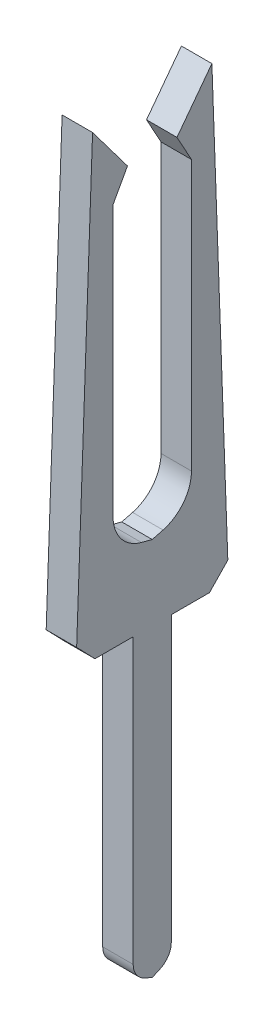
ISO-10303-21;
HEADER;
FILE_DESCRIPTION(('STEP AP214'),'2;1');
FILE_NAME('part.step','',(''),(''),'','','');
FILE_SCHEMA(('AUTOMOTIVE_DESIGN { 1 0 10303 214 1 1 1 1 }'));
ENDSEC;
DATA;
#1=APPLICATION_CONTEXT('core data for automotive mechanical design processes');
#2=APPLICATION_PROTOCOL_DEFINITION('international standard','automotive_design',2000,#1);
#3=PRODUCT_CONTEXT('',#1,'mechanical');
#4=PRODUCT('Part','Part','',(#3));
#5=PRODUCT_RELATED_PRODUCT_CATEGORY('part','',(#4));
#6=PRODUCT_DEFINITION_FORMATION('','',#4);
#7=PRODUCT_DEFINITION_CONTEXT('part definition',#1,'design');
#8=PRODUCT_DEFINITION('design','',#6,#7);
#9=PRODUCT_DEFINITION_SHAPE('','',#8);
#10=(LENGTH_UNIT() NAMED_UNIT(*) SI_UNIT(.MILLI.,.METRE.));
#11=(NAMED_UNIT(*) PLANE_ANGLE_UNIT() SI_UNIT($,.RADIAN.));
#12=(NAMED_UNIT(*) SI_UNIT($,.STERADIAN.) SOLID_ANGLE_UNIT());
#13=UNCERTAINTY_MEASURE_WITH_UNIT(LENGTH_MEASURE(1.E-05),#10,'distance_accuracy_value','');
#14=(GEOMETRIC_REPRESENTATION_CONTEXT(3) GLOBAL_UNCERTAINTY_ASSIGNED_CONTEXT((#13)) GLOBAL_UNIT_ASSIGNED_CONTEXT((#10,
#11,#12)) REPRESENTATION_CONTEXT('',''));
#15=CARTESIAN_POINT('',(0.,0.,0.));
#16=DIRECTION('',(0.,0.,1.));
#17=DIRECTION('',(1.,0.,0.));
#18=AXIS2_PLACEMENT_3D('',#15,#16,#17);
#19=CARTESIAN_POINT('',(0.4,2.15627423693323,0.277438328452502));
#20=DIRECTION('',(0.,0.694137309805425,0.71984261831048));
#21=DIRECTION('',(0.,-0.71984261831048,0.694137309805425));
#22=AXIS2_PLACEMENT_3D('',#19,#20,#21);
#23=PLANE('',#22);
#24=DIRECTION('',(0.,0.71984261831048,-0.694137309805425));
#25=VECTOR('',#24,1.);
#26=CARTESIAN_POINT('',(0.,2.15627423693323,0.277438328452502));
#27=LINE('',#26,#25);
#28=CARTESIAN_POINT('',(0.,1.90643942765456,0.518351630884458));
#29=VERTEX_POINT('',#28);
#30=CARTESIAN_POINT('',(0.,2.15627423693323,0.277438328452502));
#31=VERTEX_POINT('',#30);
#32=EDGE_CURVE('E215',#29,#31,#27,.T.);
#33=ORIENTED_EDGE('',*,*,#32,.T.);
#34=DIRECTION('',(-1.,0.,0.));
#35=VECTOR('',#34,1.);
#36=CARTESIAN_POINT('',(0.4,2.15627423693323,0.277438328452502));
#37=LINE('',#36,#35);
#38=CARTESIAN_POINT('',(0.4,2.15627423693323,0.277438328452502));
#39=VERTEX_POINT('',#38);
#40=EDGE_CURVE('E11',#39,#31,#37,.T.);
#41=ORIENTED_EDGE('',*,*,#40,.F.);
#42=DIRECTION('',(0.,0.71984261831048,-0.694137309805425));
#43=VECTOR('',#42,1.);
#44=CARTESIAN_POINT('',(0.4,2.15627423693323,0.277438328452502));
#45=LINE('',#44,#43);
#46=CARTESIAN_POINT('',(0.4,1.90643942765456,0.518351630884458));
#47=VERTEX_POINT('',#46);
#48=EDGE_CURVE('E257',#47,#39,#45,.T.);
#49=ORIENTED_EDGE('',*,*,#48,.F.);
#50=DIRECTION('',(-1.,0.,0.));
#51=VECTOR('',#50,1.);
#52=CARTESIAN_POINT('',(0.4,1.90643942765456,0.518351630884458));
#53=LINE('',#52,#51);
#54=EDGE_CURVE('E211',#47,#29,#53,.T.);
#55=ORIENTED_EDGE('',*,*,#54,.T.);
#56=EDGE_LOOP('',(#33,#41,#49,#55));
#57=FACE_BOUND('',#56,.T.);
#58=ADVANCED_FACE('F35',(#57),#23,.F.);
#59=CARTESIAN_POINT('',(0.4,7.90643942765456,0.486576567456251));
#60=DIRECTION('',(0.,-0.036346790272175,0.99933923711466));
#61=DIRECTION('',(0.,-0.99933923711466,-0.036346790272175));
#62=AXIS2_PLACEMENT_3D('',#59,#60,#61);
#63=PLANE('',#62);
#64=DIRECTION('',(0.,0.99933923711466,0.036346790272175));
#65=VECTOR('',#64,1.);
#66=CARTESIAN_POINT('',(0.,7.90643942765456,0.486576567456251));
#67=LINE('',#66,#65);
#68=CARTESIAN_POINT('',(0.,7.90643942765456,0.486576567456251));
#69=VERTEX_POINT('',#68);
#70=EDGE_CURVE('E218',#31,#69,#67,.T.);
#71=ORIENTED_EDGE('',*,*,#70,.T.);
#72=DIRECTION('',(-1.,0.,0.));
#73=VECTOR('',#72,1.);
#74=CARTESIAN_POINT('',(0.4,7.90643942765456,0.486576567456251));
#75=LINE('',#74,#73);
#76=CARTESIAN_POINT('',(0.4,7.90643942765456,0.486576567456251));
#77=VERTEX_POINT('',#76);
#78=EDGE_CURVE('E43',#77,#69,#75,.T.);
#79=ORIENTED_EDGE('',*,*,#78,.F.);
#80=DIRECTION('',(0.,0.99933923711466,0.036346790272175));
#81=VECTOR('',#80,1.);
#82=CARTESIAN_POINT('',(0.4,7.90643942765456,0.486576567456251));
#83=LINE('',#82,#81);
#84=EDGE_CURVE('E136',#39,#77,#83,.T.);
#85=ORIENTED_EDGE('',*,*,#84,.F.);
#86=ORIENTED_EDGE('',*,*,#40,.T.);
#87=EDGE_LOOP('',(#71,#79,#85,#86));
#88=FACE_BOUND('',#87,.T.);
#89=ADVANCED_FACE('F385',(#88),#63,.F.);
#90=CARTESIAN_POINT('',(0.4,7.29691604158744,0.944947879463951));
#91=DIRECTION('',(0.,-0.601030672473663,-0.799225957252301));
#92=DIRECTION('',(0.,0.799225957252301,-0.601030672473663));
#93=AXIS2_PLACEMENT_3D('',#90,#91,#92);
#94=PLANE('',#93);
#95=DIRECTION('',(0.,-0.799225957252301,0.601030672473663));
#96=VECTOR('',#95,1.);
#97=CARTESIAN_POINT('',(0.,7.29691604158744,0.944947879463951));
#98=LINE('',#97,#96);
#99=CARTESIAN_POINT('',(0.,7.29691604158744,0.944947879463951));
#100=VERTEX_POINT('',#99);
#101=EDGE_CURVE('E220',#69,#100,#98,.T.);
#102=ORIENTED_EDGE('',*,*,#101,.T.);
#103=DIRECTION('',(-1.,0.,0.));
#104=VECTOR('',#103,1.);
#105=CARTESIAN_POINT('',(0.4,7.29691604158744,0.944947879463951));
#106=LINE('',#105,#104);
#107=CARTESIAN_POINT('',(0.4,7.29691604158744,0.944947879463951));
#108=VERTEX_POINT('',#107);
#109=EDGE_CURVE('E306',#108,#100,#106,.T.);
#110=ORIENTED_EDGE('',*,*,#109,.F.);
#111=DIRECTION('',(0.,-0.799225957252301,0.601030672473663));
#112=VECTOR('',#111,1.);
#113=CARTESIAN_POINT('',(0.4,7.29691604158744,0.944947879463951));
#114=LINE('',#113,#112);
#115=EDGE_CURVE('E314',#77,#108,#114,.T.);
#116=ORIENTED_EDGE('',*,*,#115,.F.);
#117=ORIENTED_EDGE('',*,*,#78,.T.);
#118=EDGE_LOOP('',(#102,#110,#116,#117));
#119=FACE_BOUND('',#118,.T.);
#120=ADVANCED_FACE('F312',(#119),#94,.F.);
#121=CARTESIAN_POINT('',(0.4,6.95011825296304,0.754777343997982));
#122=DIRECTION('',(0.,0.480815317239039,-0.876821892238283));
#123=DIRECTION('',(0.,0.876821892238283,0.480815317239039));
#124=AXIS2_PLACEMENT_3D('',#121,#122,#123);
#125=PLANE('',#124);
#126=DIRECTION('',(0.,-0.876821892238283,-0.480815317239039));
#127=VECTOR('',#126,1.);
#128=CARTESIAN_POINT('',(0.,6.95011825296304,0.754777343997982));
#129=LINE('',#128,#127);
#130=CARTESIAN_POINT('',(0.,6.95011825296304,0.754777343997982));
#131=VERTEX_POINT('',#130);
#132=EDGE_CURVE('E222',#100,#131,#129,.T.);
#133=ORIENTED_EDGE('',*,*,#132,.T.);
#134=DIRECTION('',(-1.,0.,0.));
#135=VECTOR('',#134,1.);
#136=CARTESIAN_POINT('',(0.4,6.95011825296304,0.754777343997982));
#137=LINE('',#136,#135);
#138=CARTESIAN_POINT('',(0.4,6.95011825296304,0.754777343997982));
#139=VERTEX_POINT('',#138);
#140=EDGE_CURVE('E303',#139,#131,#137,.T.);
#141=ORIENTED_EDGE('',*,*,#140,.F.);
#142=DIRECTION('',(0.,-0.876821892238283,-0.480815317239039));
#143=VECTOR('',#142,1.);
#144=CARTESIAN_POINT('',(0.4,6.95011825296304,0.754777343997982));
#145=LINE('',#144,#143);
#146=EDGE_CURVE('E332',#108,#139,#145,.T.);
#147=ORIENTED_EDGE('',*,*,#146,.F.);
#148=ORIENTED_EDGE('',*,*,#109,.T.);
#149=EDGE_LOOP('',(#133,#141,#147,#148));
#150=FACE_BOUND('',#149,.T.);
#151=ADVANCED_FACE('F323',(#150),#125,.F.);
#152=CARTESIAN_POINT('',(0.4,3.40759606010662,0.754710604299908));
#153=DIRECTION('',(0.,1.88395991410638E-05,-0.999999999822535));
#154=DIRECTION('',(0.,0.999999999822535,1.88395991410638E-05));
#155=AXIS2_PLACEMENT_3D('',#152,#153,#154);
#156=PLANE('',#155);
#157=DIRECTION('',(0.,-0.999999999822535,-1.88395991410638E-05));
#158=VECTOR('',#157,1.);
#159=CARTESIAN_POINT('',(0.,3.40759606010662,0.754710604299908));
#160=LINE('',#159,#158);
#161=CARTESIAN_POINT('',(0.,3.40759606010662,0.754710604299908));
#162=VERTEX_POINT('',#161);
#163=EDGE_CURVE('E224',#131,#162,#160,.T.);
#164=ORIENTED_EDGE('',*,*,#163,.T.);
#165=DIRECTION('',(-1.,0.,0.));
#166=VECTOR('',#165,1.);
#167=CARTESIAN_POINT('',(0.4,3.40759606010662,0.754710604299908));
#168=LINE('',#167,#166);
#169=CARTESIAN_POINT('',(0.4,3.40759606010662,0.754710604299908));
#170=VERTEX_POINT('',#169);
#171=EDGE_CURVE('E300',#170,#162,#168,.T.);
#172=ORIENTED_EDGE('',*,*,#171,.F.);
#173=DIRECTION('',(0.,-0.999999999822535,-1.88395991410638E-05));
#174=VECTOR('',#173,1.);
#175=CARTESIAN_POINT('',(0.4,3.40759606010662,0.754710604299908));
#176=LINE('',#175,#174);
#177=EDGE_CURVE('E329',#139,#170,#176,.T.);
#178=ORIENTED_EDGE('',*,*,#177,.F.);
#179=ORIENTED_EDGE('',*,*,#140,.T.);
#180=EDGE_LOOP('',(#164,#172,#178,#179));
#181=FACE_BOUND('',#180,.T.);
#182=ADVANCED_FACE('F327',(#181),#156,.F.);
#183=CARTESIAN_POINT('',(0.4,3.40758664030705,1.25471060421118));
#184=DIRECTION('',(-1.,0.,0.));
#185=DIRECTION('',(0.,0.,1.));
#186=AXIS2_PLACEMENT_3D('',#183,#184,#185);
#187=CYLINDRICAL_SURFACE('',#186,0.5);
#188=CARTESIAN_POINT('',(0.,3.40758664030705,1.25471060421118));
#189=DIRECTION('',(-1.,0.,0.));
#190=DIRECTION('',(0.,0.,-1.));
#191=AXIS2_PLACEMENT_3D('',#188,#189,#190);
#192=CIRCLE('',#191,0.5);
#193=CARTESIAN_POINT('',(0.,2.92391221511593,1.127986295509));
#194=VERTEX_POINT('',#193);
#195=EDGE_CURVE('E226',#162,#194,#192,.T.);
#196=ORIENTED_EDGE('',*,*,#195,.T.);
#197=DIRECTION('',(-1.,0.,0.));
#198=VECTOR('',#197,1.);
#199=CARTESIAN_POINT('',(0.4,2.92391221511593,1.127986295509));
#200=LINE('',#199,#198);
#201=CARTESIAN_POINT('',(0.4,2.92391221511593,1.127986295509));
#202=VERTEX_POINT('',#201);
#203=EDGE_CURVE('E297',#202,#194,#200,.T.);
#204=ORIENTED_EDGE('',*,*,#203,.F.);
#205=CARTESIAN_POINT('',(0.4,3.40758664030705,1.25471060421118));
#206=DIRECTION('',(-1.,0.,0.));
#207=DIRECTION('',(0.,0.,-1.));
#208=AXIS2_PLACEMENT_3D('',#205,#206,#207);
#209=CIRCLE('',#208,0.5);
#210=EDGE_CURVE('E331',#170,#202,#209,.T.);
#211=ORIENTED_EDGE('',*,*,#210,.F.);
#212=ORIENTED_EDGE('',*,*,#171,.T.);
#213=EDGE_LOOP('',(#196,#204,#211,#212));
#214=FACE_BOUND('',#213,.T.);
#215=ADVANCED_FACE('F398',(#214),#187,.F.);
#216=CARTESIAN_POINT('',(0.4,2.88671780777912,1.26994787946395));
#217=DIRECTION('',(0.,-0.967348850382229,-0.253448617404358));
#218=DIRECTION('',(0.,0.253448617404358,-0.967348850382229));
#219=AXIS2_PLACEMENT_3D('',#216,#217,#218);
#220=PLANE('',#219);
#221=DIRECTION('',(0.,-0.253448617404358,0.967348850382229));
#222=VECTOR('',#221,1.);
#223=CARTESIAN_POINT('',(0.,2.88671780777912,1.26994787946395));
#224=LINE('',#223,#222);
#225=CARTESIAN_POINT('',(0.,2.88671780777912,1.26994787946395));
#226=VERTEX_POINT('',#225);
#227=EDGE_CURVE('E228',#194,#226,#224,.T.);
#228=ORIENTED_EDGE('',*,*,#227,.T.);
#229=DIRECTION('',(-1.,0.,0.));
#230=VECTOR('',#229,1.);
#231=CARTESIAN_POINT('',(0.4,2.88671780777912,1.26994787946395));
#232=LINE('',#231,#230);
#233=CARTESIAN_POINT('',(0.4,2.88671780777912,1.26994787946395));
#234=VERTEX_POINT('',#233);
#235=EDGE_CURVE('E294',#234,#226,#232,.T.);
#236=ORIENTED_EDGE('',*,*,#235,.F.);
#237=DIRECTION('',(0.,-0.253448617404358,0.967348850382229));
#238=VECTOR('',#237,1.);
#239=CARTESIAN_POINT('',(0.4,2.88671780777912,1.26994787946395));
#240=LINE('',#239,#238);
#241=EDGE_CURVE('E334',#202,#234,#240,.T.);
#242=ORIENTED_EDGE('',*,*,#241,.F.);
#243=ORIENTED_EDGE('',*,*,#203,.T.);
#244=EDGE_LOOP('',(#228,#236,#242,#243));
#245=FACE_BOUND('',#244,.T.);
#246=ADVANCED_FACE('F401',(#245),#220,.F.);
#247=CARTESIAN_POINT('',(0.4,2.88671780777912,1.26994787946395));
#248=DIRECTION('',(0.,-0.967348850382229,0.253448617404358));
#249=DIRECTION('',(0.,-0.253448617404358,-0.967348850382229));
#250=AXIS2_PLACEMENT_3D('',#247,#248,#249);
#251=PLANE('',#250);
#252=DIRECTION('',(0.,0.253448617404358,0.967348850382229));
#253=VECTOR('',#252,1.);
#254=CARTESIAN_POINT('',(0.,2.88671780777912,1.26994787946395));
#255=LINE('',#254,#253);
#256=CARTESIAN_POINT('',(0.,2.92391221511593,1.4119094634189));
#257=VERTEX_POINT('',#256);
#258=EDGE_CURVE('E230',#226,#257,#255,.T.);
#259=ORIENTED_EDGE('',*,*,#258,.T.);
#260=DIRECTION('',(-1.,0.,0.));
#261=VECTOR('',#260,1.);
#262=CARTESIAN_POINT('',(0.4,2.92391221511593,1.4119094634189));
#263=LINE('',#262,#261);
#264=CARTESIAN_POINT('',(0.4,2.92391221511593,1.4119094634189));
#265=VERTEX_POINT('',#264);
#266=EDGE_CURVE('E291',#265,#257,#263,.T.);
#267=ORIENTED_EDGE('',*,*,#266,.F.);
#268=DIRECTION('',(0.,0.253448617404358,0.967348850382229));
#269=VECTOR('',#268,1.);
#270=CARTESIAN_POINT('',(0.4,2.88671780777912,1.26994787946395));
#271=LINE('',#270,#269);
#272=EDGE_CURVE('E340',#234,#265,#271,.T.);
#273=ORIENTED_EDGE('',*,*,#272,.F.);
#274=ORIENTED_EDGE('',*,*,#235,.T.);
#275=EDGE_LOOP('',(#259,#267,#273,#274));
#276=FACE_BOUND('',#275,.T.);
#277=ADVANCED_FACE('F405',(#276),#251,.F.);
#278=CARTESIAN_POINT('',(0.4,3.40758664030705,1.28518515471672));
#279=DIRECTION('',(-1.,0.,0.));
#280=DIRECTION('',(0.,0.,1.));
#281=AXIS2_PLACEMENT_3D('',#278,#279,#280);
#282=CYLINDRICAL_SURFACE('',#281,0.5);
#283=CARTESIAN_POINT('',(0.,3.40758664030705,1.28518515471672));
#284=DIRECTION('',(-1.,0.,0.));
#285=DIRECTION('',(0.,0.,1.));
#286=AXIS2_PLACEMENT_3D('',#283,#284,#285);
#287=CIRCLE('',#286,0.5);
#288=CARTESIAN_POINT('',(0.,3.40759606010662,1.78518515462799));
#289=VERTEX_POINT('',#288);
#290=EDGE_CURVE('E232',#257,#289,#287,.T.);
#291=ORIENTED_EDGE('',*,*,#290,.T.);
#292=DIRECTION('',(-1.,0.,0.));
#293=VECTOR('',#292,1.);
#294=CARTESIAN_POINT('',(0.4,3.40759606010662,1.78518515462799));
#295=LINE('',#294,#293);
#296=CARTESIAN_POINT('',(0.4,3.40759606010662,1.78518515462799));
#297=VERTEX_POINT('',#296);
#298=EDGE_CURVE('E288',#297,#289,#295,.T.);
#299=ORIENTED_EDGE('',*,*,#298,.F.);
#300=CARTESIAN_POINT('',(0.4,3.40758664030705,1.28518515471672));
#301=DIRECTION('',(-1.,0.,0.));
#302=DIRECTION('',(0.,0.,1.));
#303=AXIS2_PLACEMENT_3D('',#300,#301,#302);
#304=CIRCLE('',#303,0.5);
#305=EDGE_CURVE('E342',#265,#297,#304,.T.);
#306=ORIENTED_EDGE('',*,*,#305,.F.);
#307=ORIENTED_EDGE('',*,*,#266,.T.);
#308=EDGE_LOOP('',(#291,#299,#306,#307));
#309=FACE_BOUND('',#308,.T.);
#310=ADVANCED_FACE('F409',(#309),#282,.F.);
#311=CARTESIAN_POINT('',(0.4,3.40759606010662,1.78518515462799));
#312=DIRECTION('',(0.,1.88395991408802E-05,0.999999999822535));
#313=DIRECTION('',(0.,-0.999999999822535,1.88395991408802E-05));
#314=AXIS2_PLACEMENT_3D('',#311,#312,#313);
#315=PLANE('',#314);
#316=DIRECTION('',(0.,0.999999999822535,-1.88395991408802E-05));
#317=VECTOR('',#316,1.);
#318=CARTESIAN_POINT('',(0.,3.40759606010662,1.78518515462799));
#319=LINE('',#318,#317);
#320=CARTESIAN_POINT('',(0.,6.95011825296304,1.78511841492992));
#321=VERTEX_POINT('',#320);
#322=EDGE_CURVE('E234',#289,#321,#319,.T.);
#323=ORIENTED_EDGE('',*,*,#322,.T.);
#324=DIRECTION('',(-1.,0.,0.));
#325=VECTOR('',#324,1.);
#326=CARTESIAN_POINT('',(0.4,6.95011825296304,1.78511841492992));
#327=LINE('',#326,#325);
#328=CARTESIAN_POINT('',(0.4,6.95011825296304,1.78511841492992));
#329=VERTEX_POINT('',#328);
#330=EDGE_CURVE('E285',#329,#321,#327,.T.);
#331=ORIENTED_EDGE('',*,*,#330,.F.);
#332=DIRECTION('',(0.,0.999999999822535,-1.88395991408802E-05));
#333=VECTOR('',#332,1.);
#334=CARTESIAN_POINT('',(0.4,3.40759606010662,1.78518515462799));
#335=LINE('',#334,#333);
#336=EDGE_CURVE('E344',#297,#329,#335,.T.);
#337=ORIENTED_EDGE('',*,*,#336,.F.);
#338=ORIENTED_EDGE('',*,*,#298,.T.);
#339=EDGE_LOOP('',(#323,#331,#337,#338));
#340=FACE_BOUND('',#339,.T.);
#341=ADVANCED_FACE('F413',(#340),#315,.F.);
#342=CARTESIAN_POINT('',(0.4,6.95011825296304,1.78511841492992));
#343=DIRECTION('',(0.,0.480815317239038,0.876821892238283));
#344=DIRECTION('',(0.,-0.876821892238283,0.480815317239038));
#345=AXIS2_PLACEMENT_3D('',#342,#343,#344);
#346=PLANE('',#345);
#347=DIRECTION('',(0.,0.876821892238283,-0.480815317239038));
#348=VECTOR('',#347,1.);
#349=CARTESIAN_POINT('',(0.,6.95011825296304,1.78511841492992));
#350=LINE('',#349,#348);
#351=CARTESIAN_POINT('',(0.,7.29691604158744,1.59494787946395));
#352=VERTEX_POINT('',#351);
#353=EDGE_CURVE('E236',#321,#352,#350,.T.);
#354=ORIENTED_EDGE('',*,*,#353,.T.);
#355=DIRECTION('',(-1.,0.,0.));
#356=VECTOR('',#355,1.);
#357=CARTESIAN_POINT('',(0.4,7.29691604158744,1.59494787946395));
#358=LINE('',#357,#356);
#359=CARTESIAN_POINT('',(0.4,7.29691604158744,1.59494787946395));
#360=VERTEX_POINT('',#359);
#361=EDGE_CURVE('E282',#360,#352,#358,.T.);
#362=ORIENTED_EDGE('',*,*,#361,.F.);
#363=DIRECTION('',(0.,0.876821892238283,-0.480815317239038));
#364=VECTOR('',#363,1.);
#365=CARTESIAN_POINT('',(0.4,6.95011825296304,1.78511841492992));
#366=LINE('',#365,#364);
#367=EDGE_CURVE('E346',#329,#360,#366,.T.);
#368=ORIENTED_EDGE('',*,*,#367,.F.);
#369=ORIENTED_EDGE('',*,*,#330,.T.);
#370=EDGE_LOOP('',(#354,#362,#368,#369));
#371=FACE_BOUND('',#370,.T.);
#372=ADVANCED_FACE('F417',(#371),#346,.F.);
#373=CARTESIAN_POINT('',(0.4,7.29691604158744,1.59494787946395));
#374=DIRECTION('',(0.,-0.601030672473662,0.799225957252301));
#375=DIRECTION('',(0.,-0.799225957252301,-0.601030672473662));
#376=AXIS2_PLACEMENT_3D('',#373,#374,#375);
#377=PLANE('',#376);
#378=DIRECTION('',(0.,0.799225957252301,0.601030672473662));
#379=VECTOR('',#378,1.);
#380=CARTESIAN_POINT('',(0.,7.29691604158744,1.59494787946395));
#381=LINE('',#380,#379);
#382=CARTESIAN_POINT('',(0.,7.90643942765456,2.05331919147165));
#383=VERTEX_POINT('',#382);
#384=EDGE_CURVE('E238',#352,#383,#381,.T.);
#385=ORIENTED_EDGE('',*,*,#384,.T.);
#386=DIRECTION('',(-1.,0.,0.));
#387=VECTOR('',#386,1.);
#388=CARTESIAN_POINT('',(0.4,7.90643942765456,2.05331919147165));
#389=LINE('',#388,#387);
#390=CARTESIAN_POINT('',(0.4,7.90643942765456,2.05331919147165));
#391=VERTEX_POINT('',#390);
#392=EDGE_CURVE('E279',#391,#383,#389,.T.);
#393=ORIENTED_EDGE('',*,*,#392,.F.);
#394=DIRECTION('',(0.,0.799225957252301,0.601030672473662));
#395=VECTOR('',#394,1.);
#396=CARTESIAN_POINT('',(0.4,7.29691604158744,1.59494787946395));
#397=LINE('',#396,#395);
#398=EDGE_CURVE('E348',#360,#391,#397,.T.);
#399=ORIENTED_EDGE('',*,*,#398,.F.);
#400=ORIENTED_EDGE('',*,*,#361,.T.);
#401=EDGE_LOOP('',(#385,#393,#399,#400));
#402=FACE_BOUND('',#401,.T.);
#403=ADVANCED_FACE('F421',(#402),#377,.F.);
#404=CARTESIAN_POINT('',(0.4,7.90643942765456,2.05331919147165));
#405=DIRECTION('',(0.,-0.0363467902721749,-0.99933923711466));
#406=DIRECTION('',(0.,0.99933923711466,-0.0363467902721749));
#407=AXIS2_PLACEMENT_3D('',#404,#405,#406);
#408=PLANE('',#407);
#409=DIRECTION('',(0.,-0.99933923711466,0.0363467902721749));
#410=VECTOR('',#409,1.);
#411=CARTESIAN_POINT('',(0.,7.90643942765456,2.05331919147165));
#412=LINE('',#411,#410);
#413=CARTESIAN_POINT('',(0.,2.15627423693323,2.26245743047539));
#414=VERTEX_POINT('',#413);
#415=EDGE_CURVE('E240',#383,#414,#412,.T.);
#416=ORIENTED_EDGE('',*,*,#415,.T.);
#417=DIRECTION('',(-1.,0.,0.));
#418=VECTOR('',#417,1.);
#419=CARTESIAN_POINT('',(0.4,2.15627423693323,2.26245743047539));
#420=LINE('',#419,#418);
#421=CARTESIAN_POINT('',(0.4,2.15627423693323,2.26245743047539));
#422=VERTEX_POINT('',#421);
#423=EDGE_CURVE('E276',#422,#414,#420,.T.);
#424=ORIENTED_EDGE('',*,*,#423,.F.);
#425=DIRECTION('',(0.,-0.99933923711466,0.0363467902721749));
#426=VECTOR('',#425,1.);
#427=CARTESIAN_POINT('',(0.4,7.90643942765456,2.05331919147165));
#428=LINE('',#427,#426);
#429=EDGE_CURVE('E350',#391,#422,#428,.T.);
#430=ORIENTED_EDGE('',*,*,#429,.F.);
#431=ORIENTED_EDGE('',*,*,#392,.T.);
#432=EDGE_LOOP('',(#416,#424,#430,#431));
#433=FACE_BOUND('',#432,.T.);
#434=ADVANCED_FACE('F425',(#433),#408,.F.);
#435=CARTESIAN_POINT('',(0.4,2.15627423693323,2.26245743047539));
#436=DIRECTION('',(0.,0.694137309805425,-0.71984261831048));
#437=DIRECTION('',(0.,0.71984261831048,0.694137309805426));
#438=AXIS2_PLACEMENT_3D('',#435,#436,#437);
#439=PLANE('',#438);
#440=DIRECTION('',(0.,-0.71984261831048,-0.694137309805426));
#441=VECTOR('',#440,1.);
#442=CARTESIAN_POINT('',(0.,2.15627423693323,2.26245743047539));
#443=LINE('',#442,#441);
#444=CARTESIAN_POINT('',(0.,1.90643942765456,2.02154412804344));
#445=VERTEX_POINT('',#444);
#446=EDGE_CURVE('E242',#414,#445,#443,.T.);
#447=ORIENTED_EDGE('',*,*,#446,.T.);
#448=DIRECTION('',(-1.,0.,0.));
#449=VECTOR('',#448,1.);
#450=CARTESIAN_POINT('',(0.4,1.90643942765456,2.02154412804344));
#451=LINE('',#450,#449);
#452=CARTESIAN_POINT('',(0.4,1.90643942765456,2.02154412804344));
#453=VERTEX_POINT('',#452);
#454=EDGE_CURVE('E273',#453,#445,#451,.T.);
#455=ORIENTED_EDGE('',*,*,#454,.F.);
#456=DIRECTION('',(0.,-0.71984261831048,-0.694137309805426));
#457=VECTOR('',#456,1.);
#458=CARTESIAN_POINT('',(0.4,2.15627423693323,2.26245743047539));
#459=LINE('',#458,#457);
#460=EDGE_CURVE('E352',#422,#453,#459,.T.);
#461=ORIENTED_EDGE('',*,*,#460,.F.);
#462=ORIENTED_EDGE('',*,*,#423,.T.);
#463=EDGE_LOOP('',(#447,#455,#461,#462));
#464=FACE_BOUND('',#463,.T.);
#465=ADVANCED_FACE('F429',(#464),#439,.F.);
#466=CARTESIAN_POINT('',(0.4,1.90643942765456,2.02154412804344));
#467=DIRECTION('',(0.,1.,0.));
#468=DIRECTION('',(0.,0.,1.));
#469=AXIS2_PLACEMENT_3D('',#466,#467,#468);
#470=PLANE('',#469);
#471=DIRECTION('',(0.,0.,-1.));
#472=VECTOR('',#471,1.);
#473=CARTESIAN_POINT('',(0.,1.90643942765456,2.02154412804344));
#474=LINE('',#473,#472);
#475=CARTESIAN_POINT('',(0.,1.90643942765456,1.51994787946395));
#476=VERTEX_POINT('',#475);
#477=EDGE_CURVE('E244',#445,#476,#474,.T.);
#478=ORIENTED_EDGE('',*,*,#477,.T.);
#479=DIRECTION('',(-1.,0.,0.));
#480=VECTOR('',#479,1.);
#481=CARTESIAN_POINT('',(0.4,1.90643942765456,1.51994787946395));
#482=LINE('',#481,#480);
#483=CARTESIAN_POINT('',(0.4,1.90643942765456,1.51994787946395));
#484=VERTEX_POINT('',#483);
#485=EDGE_CURVE('E270',#484,#476,#482,.T.);
#486=ORIENTED_EDGE('',*,*,#485,.F.);
#487=DIRECTION('',(0.,0.,-1.));
#488=VECTOR('',#487,1.);
#489=CARTESIAN_POINT('',(0.4,1.90643942765456,2.02154412804344));
#490=LINE('',#489,#488);
#491=EDGE_CURVE('E354',#453,#484,#490,.T.);
#492=ORIENTED_EDGE('',*,*,#491,.F.);
#493=ORIENTED_EDGE('',*,*,#454,.T.);
#494=EDGE_LOOP('',(#478,#486,#492,#493));
#495=FACE_BOUND('',#494,.T.);
#496=ADVANCED_FACE('F433',(#495),#470,.F.);
#497=CARTESIAN_POINT('',(0.4,1.90643942765456,1.51994787946395));
#498=DIRECTION('',(0.,0.,-1.));
#499=DIRECTION('',(0.,1.,0.));
#500=AXIS2_PLACEMENT_3D('',#497,#498,#499);
#501=PLANE('',#500);
#502=DIRECTION('',(0.,-1.,0.));
#503=VECTOR('',#502,1.);
#504=CARTESIAN_POINT('',(0.,1.90643942765456,1.51994787946395));
#505=LINE('',#504,#503);
#506=CARTESIAN_POINT('',(0.,-1.82003778744792,1.51994787946395));
#507=VERTEX_POINT('',#506);
#508=EDGE_CURVE('E246',#476,#507,#505,.T.);
#509=ORIENTED_EDGE('',*,*,#508,.T.);
#510=DIRECTION('',(-1.,0.,0.));
#511=VECTOR('',#510,1.);
#512=CARTESIAN_POINT('',(0.4,-1.82003778744792,1.51994787946395));
#513=LINE('',#512,#511);
#514=CARTESIAN_POINT('',(0.4,-1.82003778744792,1.51994787946395));
#515=VERTEX_POINT('',#514);
#516=EDGE_CURVE('E267',#515,#507,#513,.T.);
#517=ORIENTED_EDGE('',*,*,#516,.F.);
#518=DIRECTION('',(0.,-1.,0.));
#519=VECTOR('',#518,1.);
#520=CARTESIAN_POINT('',(0.4,1.90643942765456,1.51994787946395));
#521=LINE('',#520,#519);
#522=EDGE_CURVE('E356',#484,#515,#521,.T.);
#523=ORIENTED_EDGE('',*,*,#522,.F.);
#524=ORIENTED_EDGE('',*,*,#485,.T.);
#525=EDGE_LOOP('',(#509,#517,#523,#524));
#526=FACE_BOUND('',#525,.T.);
#527=ADVANCED_FACE('F437',(#526),#501,.F.);
#528=CARTESIAN_POINT('',(0.4,-1.82003778744792,1.26994787946395));
#529=DIRECTION('',(-1.,0.,0.));
#530=DIRECTION('',(0.,0.,1.));
#531=AXIS2_PLACEMENT_3D('',#528,#529,#530);
#532=CYLINDRICAL_SURFACE('',#531,0.249999999999999);
#533=CARTESIAN_POINT('',(0.,-1.82003778744792,1.26994787946395));
#534=DIRECTION('',(1.,0.,0.));
#535=DIRECTION('',(0.,0.,-1.));
#536=AXIS2_PLACEMENT_3D('',#533,#534,#535);
#537=CIRCLE('',#536,0.249999999999999);
#538=CARTESIAN_POINT('',(0.,-2.04853794703578,1.37137606621853));
#539=VERTEX_POINT('',#538);
#540=EDGE_CURVE('E248',#507,#539,#537,.T.);
#541=ORIENTED_EDGE('',*,*,#540,.T.);
#542=DIRECTION('',(-1.,0.,0.));
#543=VECTOR('',#542,1.);
#544=CARTESIAN_POINT('',(0.4,-2.04853794703578,1.37137606621853));
#545=LINE('',#544,#543);
#546=CARTESIAN_POINT('',(0.4,-2.04853794703578,1.37137606621853));
#547=VERTEX_POINT('',#546);
#548=EDGE_CURVE('E264',#547,#539,#545,.T.);
#549=ORIENTED_EDGE('',*,*,#548,.F.);
#550=CARTESIAN_POINT('',(0.4,-1.82003778744792,1.26994787946395));
#551=DIRECTION('',(1.,0.,0.));
#552=DIRECTION('',(0.,0.,-1.));
#553=AXIS2_PLACEMENT_3D('',#550,#551,#552);
#554=CIRCLE('',#553,0.249999999999999);
#555=EDGE_CURVE('E358',#515,#547,#554,.T.);
#556=ORIENTED_EDGE('',*,*,#555,.F.);
#557=ORIENTED_EDGE('',*,*,#516,.T.);
#558=EDGE_LOOP('',(#541,#549,#556,#557));
#559=FACE_BOUND('',#558,.T.);
#560=ADVANCED_FACE('F441',(#559),#532,.T.);
#561=CARTESIAN_POINT('',(0.4,-2.04853794703578,1.37137606621853));
#562=DIRECTION('',(0.,0.914000638351446,-0.405712747018317));
#563=DIRECTION('',(0.,0.405712747018317,0.914000638351446));
#564=AXIS2_PLACEMENT_3D('',#561,#562,#563);
#565=PLANE('',#564);
#566=DIRECTION('',(0.,-0.405712747018317,-0.914000638351446));
#567=VECTOR('',#566,1.);
#568=CARTESIAN_POINT('',(0.,-2.04853794703578,1.37137606621853));
#569=LINE('',#568,#567);
#570=CARTESIAN_POINT('',(0.,-2.09356057234545,1.26994787946395));
#571=VERTEX_POINT('',#570);
#572=EDGE_CURVE('E250',#539,#571,#569,.T.);
#573=ORIENTED_EDGE('',*,*,#572,.T.);
#574=DIRECTION('',(-1.,0.,0.));
#575=VECTOR('',#574,1.);
#576=CARTESIAN_POINT('',(0.4,-2.09356057234545,1.26994787946395));
#577=LINE('',#576,#575);
#578=CARTESIAN_POINT('',(0.4,-2.09356057234545,1.26994787946395));
#579=VERTEX_POINT('',#578);
#580=EDGE_CURVE('E261',#579,#571,#577,.T.);
#581=ORIENTED_EDGE('',*,*,#580,.F.);
#582=DIRECTION('',(0.,-0.405712747018317,-0.914000638351446));
#583=VECTOR('',#582,1.);
#584=CARTESIAN_POINT('',(0.4,-2.04853794703578,1.37137606621853));
#585=LINE('',#584,#583);
#586=EDGE_CURVE('E360',#547,#579,#585,.T.);
#587=ORIENTED_EDGE('',*,*,#586,.F.);
#588=ORIENTED_EDGE('',*,*,#548,.T.);
#589=EDGE_LOOP('',(#573,#581,#587,#588));
#590=FACE_BOUND('',#589,.T.);
#591=ADVANCED_FACE('F366',(#590),#565,.F.);
#592=CARTESIAN_POINT('',(0.4,-2.04853794703579,1.16851969270938));
#593=DIRECTION('',(0.,0.914000638351438,0.405712747018336));
#594=DIRECTION('',(0.,-0.405712747018336,0.914000638351438));
#595=AXIS2_PLACEMENT_3D('',#592,#593,#594);
#596=PLANE('',#595);
#597=DIRECTION('',(0.,0.405712747018336,-0.914000638351438));
#598=VECTOR('',#597,1.);
#599=CARTESIAN_POINT('',(0.,-2.04853794703579,1.16851969270938));
#600=LINE('',#599,#598);
#601=CARTESIAN_POINT('',(0.,-2.04853794703579,1.16851969270938));
#602=VERTEX_POINT('',#601);
#603=EDGE_CURVE('E252',#571,#602,#600,.T.);
#604=ORIENTED_EDGE('',*,*,#603,.T.);
#605=DIRECTION('',(-1.,0.,0.));
#606=VECTOR('',#605,1.);
#607=CARTESIAN_POINT('',(0.4,-2.04853794703579,1.16851969270938));
#608=LINE('',#607,#606);
#609=CARTESIAN_POINT('',(0.4,-2.04853794703579,1.16851969270938));
#610=VERTEX_POINT('',#609);
#611=EDGE_CURVE('E206',#610,#602,#608,.T.);
#612=ORIENTED_EDGE('',*,*,#611,.F.);
#613=DIRECTION('',(0.,0.405712747018336,-0.914000638351438));
#614=VECTOR('',#613,1.);
#615=CARTESIAN_POINT('',(0.4,-2.04853794703579,1.16851969270938));
#616=LINE('',#615,#614);
#617=EDGE_CURVE('E197',#579,#610,#616,.T.);
#618=ORIENTED_EDGE('',*,*,#617,.F.);
#619=ORIENTED_EDGE('',*,*,#580,.T.);
#620=EDGE_LOOP('',(#604,#612,#618,#619));
#621=FACE_BOUND('',#620,.T.);
#622=ADVANCED_FACE('F370',(#621),#596,.F.);
#623=CARTESIAN_POINT('',(0.4,-1.82003778744792,1.26994787946395));
#624=DIRECTION('',(-1.,0.,0.));
#625=DIRECTION('',(0.,0.,1.));
#626=AXIS2_PLACEMENT_3D('',#623,#624,#625);
#627=CYLINDRICAL_SURFACE('',#626,0.25);
#628=CARTESIAN_POINT('',(0.,-1.82003778744792,1.26994787946395));
#629=DIRECTION('',(1.,0.,0.));
#630=DIRECTION('',(0.,0.,1.));
#631=AXIS2_PLACEMENT_3D('',#628,#629,#630);
#632=CIRCLE('',#631,0.25);
#633=CARTESIAN_POINT('',(0.,-1.82003778744792,1.01994787946395));
#634=VERTEX_POINT('',#633);
#635=EDGE_CURVE('E205',#602,#634,#632,.T.);
#636=ORIENTED_EDGE('',*,*,#635,.T.);
#637=DIRECTION('',(-1.,0.,0.));
#638=VECTOR('',#637,1.);
#639=CARTESIAN_POINT('',(0.4,-1.82003778744792,1.01994787946395));
#640=LINE('',#639,#638);
#641=CARTESIAN_POINT('',(0.4,-1.82003778744792,1.01994787946395));
#642=VERTEX_POINT('',#641);
#643=EDGE_CURVE('E202',#642,#634,#640,.T.);
#644=ORIENTED_EDGE('',*,*,#643,.F.);
#645=CARTESIAN_POINT('',(0.4,-1.82003778744792,1.26994787946395));
#646=DIRECTION('',(1.,0.,0.));
#647=DIRECTION('',(0.,0.,1.));
#648=AXIS2_PLACEMENT_3D('',#645,#646,#647);
#649=CIRCLE('',#648,0.25);
#650=EDGE_CURVE('E191',#610,#642,#649,.T.);
#651=ORIENTED_EDGE('',*,*,#650,.F.);
#652=ORIENTED_EDGE('',*,*,#611,.T.);
#653=EDGE_LOOP('',(#636,#644,#651,#652));
#654=FACE_BOUND('',#653,.T.);
#655=ADVANCED_FACE('F203',(#654),#627,.T.);
#656=CARTESIAN_POINT('',(0.4,1.90643942765456,1.01994787946395));
#657=DIRECTION('',(0.,0.,1.));
#658=DIRECTION('',(1.,0.,0.));
#659=AXIS2_PLACEMENT_3D('',#656,#657,#658);
#660=PLANE('',#659);
#661=DIRECTION('',(0.,1.,0.));
#662=VECTOR('',#661,1.);
#663=CARTESIAN_POINT('',(0.,1.90643942765456,1.01994787946395));
#664=LINE('',#663,#662);
#665=CARTESIAN_POINT('',(0.,1.90643942765456,1.01994787946395));
#666=VERTEX_POINT('',#665);
#667=EDGE_CURVE('E122',#634,#666,#664,.T.);
#668=ORIENTED_EDGE('',*,*,#667,.T.);
#669=DIRECTION('',(-1.,0.,0.));
#670=VECTOR('',#669,1.);
#671=CARTESIAN_POINT('',(0.4,1.90643942765456,1.01994787946395));
#672=LINE('',#671,#670);
#673=CARTESIAN_POINT('',(0.4,1.90643942765456,1.01994787946395));
#674=VERTEX_POINT('',#673);
#675=EDGE_CURVE('E207',#674,#666,#672,.T.);
#676=ORIENTED_EDGE('',*,*,#675,.F.);
#677=DIRECTION('',(0.,1.,0.));
#678=VECTOR('',#677,1.);
#679=CARTESIAN_POINT('',(0.4,1.90643942765456,1.01994787946395));
#680=LINE('',#679,#678);
#681=EDGE_CURVE('E195',#642,#674,#680,.T.);
#682=ORIENTED_EDGE('',*,*,#681,.F.);
#683=ORIENTED_EDGE('',*,*,#643,.T.);
#684=EDGE_LOOP('',(#668,#676,#682,#683));
#685=FACE_BOUND('',#684,.T.);
#686=ADVANCED_FACE('F209',(#685),#660,.F.);
#687=CARTESIAN_POINT('',(0.4,1.90643942765456,0.518351630884458));
#688=DIRECTION('',(0.,1.,0.));
#689=DIRECTION('',(0.,0.,1.));
#690=AXIS2_PLACEMENT_3D('',#687,#688,#689);
#691=PLANE('',#690);
#692=DIRECTION('',(0.,0.,-1.));
#693=VECTOR('',#692,1.);
#694=CARTESIAN_POINT('',(0.,1.90643942765456,0.518351630884458));
#695=LINE('',#694,#693);
#696=EDGE_CURVE('E128',#666,#29,#695,.T.);
#697=ORIENTED_EDGE('',*,*,#696,.T.);
#698=ORIENTED_EDGE('',*,*,#54,.F.);
#699=DIRECTION('',(0.,0.,-1.));
#700=VECTOR('',#699,1.);
#701=CARTESIAN_POINT('',(0.4,1.90643942765456,0.518351630884458));
#702=LINE('',#701,#700);
#703=EDGE_CURVE('E51',#674,#47,#702,.T.);
#704=ORIENTED_EDGE('',*,*,#703,.F.);
#705=ORIENTED_EDGE('',*,*,#675,.T.);
#706=EDGE_LOOP('',(#697,#698,#704,#705));
#707=FACE_BOUND('',#706,.T.);
#708=ADVANCED_FACE('F374',(#707),#691,.F.);
#709=CARTESIAN_POINT('',(0.4,-1.82003778744792,1.26994787946395));
#710=DIRECTION('',(-1.,0.,0.));
#711=DIRECTION('',(0.,0.,1.));
#712=AXIS2_PLACEMENT_3D('',#709,#710,#711);
#713=PLANE('',#712);
#714=ORIENTED_EDGE('',*,*,#48,.T.);
#715=ORIENTED_EDGE('',*,*,#84,.T.);
#716=ORIENTED_EDGE('',*,*,#115,.T.);
#717=ORIENTED_EDGE('',*,*,#146,.T.);
#718=ORIENTED_EDGE('',*,*,#177,.T.);
#719=ORIENTED_EDGE('',*,*,#210,.T.);
#720=ORIENTED_EDGE('',*,*,#241,.T.);
#721=ORIENTED_EDGE('',*,*,#272,.T.);
#722=ORIENTED_EDGE('',*,*,#305,.T.);
#723=ORIENTED_EDGE('',*,*,#336,.T.);
#724=ORIENTED_EDGE('',*,*,#367,.T.);
#725=ORIENTED_EDGE('',*,*,#398,.T.);
#726=ORIENTED_EDGE('',*,*,#429,.T.);
#727=ORIENTED_EDGE('',*,*,#460,.T.);
#728=ORIENTED_EDGE('',*,*,#491,.T.);
#729=ORIENTED_EDGE('',*,*,#522,.T.);
#730=ORIENTED_EDGE('',*,*,#555,.T.);
#731=ORIENTED_EDGE('',*,*,#586,.T.);
#732=ORIENTED_EDGE('',*,*,#617,.T.);
#733=ORIENTED_EDGE('',*,*,#650,.T.);
#734=ORIENTED_EDGE('',*,*,#681,.T.);
#735=ORIENTED_EDGE('',*,*,#703,.T.);
#736=EDGE_LOOP('',(#714,#715,#716,#717,#718,#719,#720,#721,#722,#723,#724,#725,#726,#727,#728,
#729,#730,#731,#732,#733,#734,#735));
#737=FACE_BOUND('',#736,.T.);
#738=ADVANCED_FACE('F193',(#737),#713,.F.);
#739=CARTESIAN_POINT('',(0.,-1.82003778744792,1.26994787946395));
#740=DIRECTION('',(-1.,0.,0.));
#741=DIRECTION('',(0.,0.,1.));
#742=AXIS2_PLACEMENT_3D('',#739,#740,#741);
#743=PLANE('',#742);
#744=ORIENTED_EDGE('',*,*,#32,.F.);
#745=ORIENTED_EDGE('',*,*,#696,.F.);
#746=ORIENTED_EDGE('',*,*,#667,.F.);
#747=ORIENTED_EDGE('',*,*,#635,.F.);
#748=ORIENTED_EDGE('',*,*,#603,.F.);
#749=ORIENTED_EDGE('',*,*,#572,.F.);
#750=ORIENTED_EDGE('',*,*,#540,.F.);
#751=ORIENTED_EDGE('',*,*,#508,.F.);
#752=ORIENTED_EDGE('',*,*,#477,.F.);
#753=ORIENTED_EDGE('',*,*,#446,.F.);
#754=ORIENTED_EDGE('',*,*,#415,.F.);
#755=ORIENTED_EDGE('',*,*,#384,.F.);
#756=ORIENTED_EDGE('',*,*,#353,.F.);
#757=ORIENTED_EDGE('',*,*,#322,.F.);
#758=ORIENTED_EDGE('',*,*,#290,.F.);
#759=ORIENTED_EDGE('',*,*,#258,.F.);
#760=ORIENTED_EDGE('',*,*,#227,.F.);
#761=ORIENTED_EDGE('',*,*,#195,.F.);
#762=ORIENTED_EDGE('',*,*,#163,.F.);
#763=ORIENTED_EDGE('',*,*,#132,.F.);
#764=ORIENTED_EDGE('',*,*,#101,.F.);
#765=ORIENTED_EDGE('',*,*,#70,.F.);
#766=EDGE_LOOP('',(#744,#745,#746,#747,#748,#749,#750,#751,#752,#753,#754,#755,#756,#757,#758,
#759,#760,#761,#762,#763,#764,#765));
#767=FACE_BOUND('',#766,.T.);
#768=ADVANCED_FACE('F318',(#767),#743,.T.);
#769=CLOSED_SHELL('',(#58,#89,#120,#151,#182,#215,#246,#277,#310,#341,#372,#403,#434,#465,#496,
#527,#560,#591,#622,#655,#686,#708,#738,#768));
#770=MANIFOLD_SOLID_BREP('B2',#769);
#771=ADVANCED_BREP_SHAPE_REPRESENTATION('',(#18,#770),#14);
#772=SHAPE_DEFINITION_REPRESENTATION(#9,#771);
ENDSEC;
END-ISO-10303-21;
